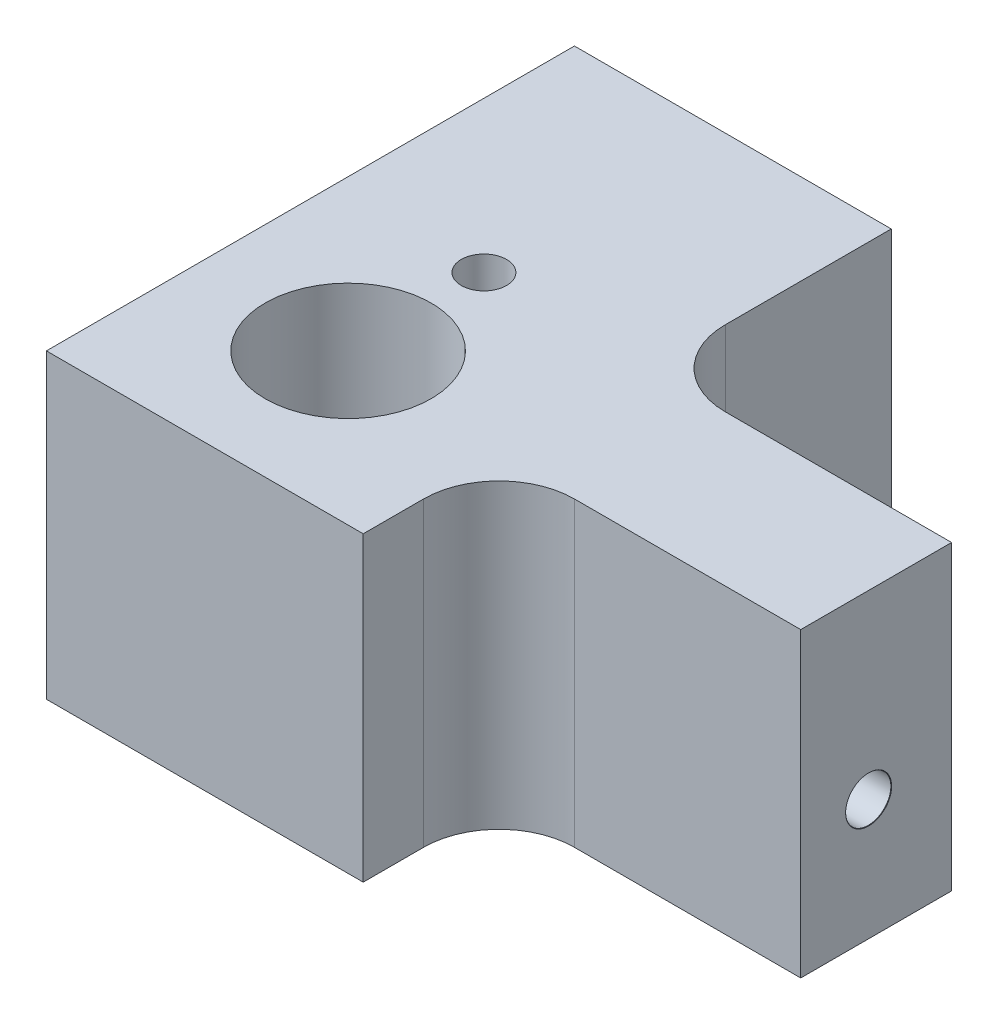
ISO-10303-21;
HEADER;
FILE_DESCRIPTION(('STEP AP214'),'2;1');
FILE_NAME('part.step','',(''),(''),'','','');
FILE_SCHEMA(('AUTOMOTIVE_DESIGN { 1 0 10303 214 1 1 1 1 }'));
ENDSEC;
DATA;
#1=APPLICATION_CONTEXT('core data for automotive mechanical design processes');
#2=APPLICATION_PROTOCOL_DEFINITION('international standard','automotive_design',2000,#1);
#3=PRODUCT_CONTEXT('',#1,'mechanical');
#4=PRODUCT('Part','Part','',(#3));
#5=PRODUCT_RELATED_PRODUCT_CATEGORY('part','',(#4));
#6=PRODUCT_DEFINITION_FORMATION('','',#4);
#7=PRODUCT_DEFINITION_CONTEXT('part definition',#1,'design');
#8=PRODUCT_DEFINITION('design','',#6,#7);
#9=PRODUCT_DEFINITION_SHAPE('','',#8);
#10=(LENGTH_UNIT() NAMED_UNIT(*) SI_UNIT(.MILLI.,.METRE.));
#11=(NAMED_UNIT(*) PLANE_ANGLE_UNIT() SI_UNIT($,.RADIAN.));
#12=(NAMED_UNIT(*) SI_UNIT($,.STERADIAN.) SOLID_ANGLE_UNIT());
#13=UNCERTAINTY_MEASURE_WITH_UNIT(LENGTH_MEASURE(1.E-05),#10,'distance_accuracy_value','');
#14=(GEOMETRIC_REPRESENTATION_CONTEXT(3) GLOBAL_UNCERTAINTY_ASSIGNED_CONTEXT((#13)) GLOBAL_UNIT_ASSIGNED_CONTEXT((#10,
#11,#12)) REPRESENTATION_CONTEXT('',''));
#15=CARTESIAN_POINT('',(0.,0.,0.));
#16=DIRECTION('',(0.,0.,1.));
#17=DIRECTION('',(1.,0.,0.));
#18=AXIS2_PLACEMENT_3D('',#15,#16,#17);
#19=CARTESIAN_POINT('',(-10.5255719557196,20.,12.690405904059));
#20=DIRECTION('',(0.,0.,-1.));
#21=DIRECTION('',(-1.,0.,0.));
#22=AXIS2_PLACEMENT_3D('',#19,#20,#21);
#23=PLANE('',#22);
#24=DIRECTION('',(1.,0.,0.));
#25=VECTOR('',#24,1.);
#26=CARTESIAN_POINT('',(-10.5255719557196,20.,12.690405904059));
#27=LINE('',#26,#25);
#28=CARTESIAN_POINT('',(-2.52557195571956,20.,12.690405904059));
#29=VERTEX_POINT('',#28);
#30=CARTESIAN_POINT('',(18.4744280442804,20.,12.690405904059));
#31=VERTEX_POINT('',#30);
#32=EDGE_CURVE('E142',#29,#31,#27,.T.);
#33=ORIENTED_EDGE('',*,*,#32,.F.);
#34=DIRECTION('',(0.,1.,0.));
#35=VECTOR('',#34,1.);
#36=CARTESIAN_POINT('',(-2.52557195571956,-8.00000000000001,12.690405904059));
#37=LINE('',#36,#35);
#38=CARTESIAN_POINT('',(-2.52557195571956,0.,12.690405904059));
#39=VERTEX_POINT('',#38);
#40=EDGE_CURVE('E123',#39,#29,#37,.T.);
#41=ORIENTED_EDGE('',*,*,#40,.F.);
#42=DIRECTION('',(1.,0.,0.));
#43=VECTOR('',#42,1.);
#44=CARTESIAN_POINT('',(-10.5255719557196,0.,12.690405904059));
#45=LINE('',#44,#43);
#46=CARTESIAN_POINT('',(18.4744280442804,0.,12.690405904059));
#47=VERTEX_POINT('',#46);
#48=EDGE_CURVE('E169',#39,#47,#45,.T.);
#49=ORIENTED_EDGE('',*,*,#48,.T.);
#50=DIRECTION('',(0.,1.,0.));
#51=VECTOR('',#50,1.);
#52=CARTESIAN_POINT('',(18.4744280442804,-8.00000000000001,12.690405904059));
#53=LINE('',#52,#51);
#54=EDGE_CURVE('E150',#47,#31,#53,.T.);
#55=ORIENTED_EDGE('',*,*,#54,.T.);
#56=EDGE_LOOP('',(#33,#41,#49,#55));
#57=FACE_BOUND('',#56,.T.);
#58=ADVANCED_FACE('F41',(#57),#23,.F.);
#59=CARTESIAN_POINT('',(38.4744280442804,20.,-22.309594095941));
#60=DIRECTION('',(-1.,0.,0.));
#61=DIRECTION('',(0.,0.,1.));
#62=AXIS2_PLACEMENT_3D('',#59,#60,#61);
#63=PLANE('',#62);
#64=CARTESIAN_POINT('',(38.4744280442804,8.,-0.809594095940968));
#65=DIRECTION('',(1.,0.,0.));
#66=DIRECTION('',(0.,0.,-1.));
#67=AXIS2_PLACEMENT_3D('',#64,#65,#66);
#68=CIRCLE('',#67,1.525);
#69=CARTESIAN_POINT('',(38.4744280442804,8.,-2.33459409594097));
#70=VERTEX_POINT('',#69);
#71=EDGE_CURVE('E258',#70,#70,#68,.T.);
#72=ORIENTED_EDGE('',*,*,#71,.F.);
#73=EDGE_LOOP('',(#72));
#74=FACE_BOUND('',#73,.T.);
#75=DIRECTION('',(0.,0.,-1.));
#76=VECTOR('',#75,1.);
#77=CARTESIAN_POINT('',(38.4744280442804,0.,-22.309594095941));
#78=LINE('',#77,#76);
#79=CARTESIAN_POINT('',(38.4744280442804,0.,3.69040590405904));
#80=VERTEX_POINT('',#79);
#81=CARTESIAN_POINT('',(38.4744280442804,0.,-6.30959409594096));
#82=VERTEX_POINT('',#81);
#83=EDGE_CURVE('E160',#80,#82,#78,.T.);
#84=ORIENTED_EDGE('',*,*,#83,.T.);
#85=DIRECTION('',(0.,1.,0.));
#86=VECTOR('',#85,1.);
#87=CARTESIAN_POINT('',(38.4744280442804,-8.00000000000001,-6.30959409594096));
#88=LINE('',#87,#86);
#89=CARTESIAN_POINT('',(38.4744280442804,20.,-6.30959409594096));
#90=VERTEX_POINT('',#89);
#91=EDGE_CURVE('E238',#82,#90,#88,.T.);
#92=ORIENTED_EDGE('',*,*,#91,.T.);
#93=DIRECTION('',(0.,0.,-1.));
#94=VECTOR('',#93,1.);
#95=CARTESIAN_POINT('',(38.4744280442804,20.,-22.309594095941));
#96=LINE('',#95,#94);
#97=CARTESIAN_POINT('',(38.4744280442804,20.,3.69040590405904));
#98=VERTEX_POINT('',#97);
#99=EDGE_CURVE('E152',#98,#90,#96,.T.);
#100=ORIENTED_EDGE('',*,*,#99,.F.);
#101=DIRECTION('',(0.,1.,0.));
#102=VECTOR('',#101,1.);
#103=CARTESIAN_POINT('',(38.4744280442804,-8.00000000000001,3.69040590405904));
#104=LINE('',#103,#102);
#105=EDGE_CURVE('E232',#80,#98,#104,.T.);
#106=ORIENTED_EDGE('',*,*,#105,.F.);
#107=EDGE_LOOP('',(#84,#92,#100,#106));
#108=FACE_BOUND('',#107,.T.);
#109=ADVANCED_FACE('F298',(#74,#108),#63,.F.);
#110=CARTESIAN_POINT('',(-10.5255719557196,20.,-22.309594095941));
#111=DIRECTION('',(0.,0.,1.));
#112=DIRECTION('',(1.,0.,0.));
#113=AXIS2_PLACEMENT_3D('',#110,#111,#112);
#114=PLANE('',#113);
#115=CARTESIAN_POINT('',(7.47442804428043,4.,-22.309594095941));
#116=DIRECTION('',(0.,0.,-1.));
#117=DIRECTION('',(-1.,0.,0.));
#118=AXIS2_PLACEMENT_3D('',#115,#116,#117);
#119=CIRCLE('',#118,1.525);
#120=CARTESIAN_POINT('',(5.94942804428043,4.,-22.309594095941));
#121=VERTEX_POINT('',#120);
#122=EDGE_CURVE('E270',#121,#121,#119,.T.);
#123=ORIENTED_EDGE('',*,*,#122,.F.);
#124=EDGE_LOOP('',(#123));
#125=FACE_BOUND('',#124,.T.);
#126=DIRECTION('',(-1.,0.,0.));
#127=VECTOR('',#126,1.);
#128=CARTESIAN_POINT('',(-10.5255719557196,0.,-22.309594095941));
#129=LINE('',#128,#127);
#130=CARTESIAN_POINT('',(18.4744280442804,0.,-22.309594095941));
#131=VERTEX_POINT('',#130);
#132=CARTESIAN_POINT('',(-2.52557195571957,0.,-22.309594095941));
#133=VERTEX_POINT('',#132);
#134=EDGE_CURVE('E153',#131,#133,#129,.T.);
#135=ORIENTED_EDGE('',*,*,#134,.T.);
#136=DIRECTION('',(0.,1.,0.));
#137=VECTOR('',#136,1.);
#138=CARTESIAN_POINT('',(-2.52557195571957,-8.00000000000001,-22.309594095941));
#139=LINE('',#138,#137);
#140=CARTESIAN_POINT('',(-2.52557195571957,20.,-22.309594095941));
#141=VERTEX_POINT('',#140);
#142=EDGE_CURVE('E135',#133,#141,#139,.T.);
#143=ORIENTED_EDGE('',*,*,#142,.T.);
#144=DIRECTION('',(-1.,0.,0.));
#145=VECTOR('',#144,1.);
#146=CARTESIAN_POINT('',(-10.5255719557196,20.,-22.309594095941));
#147=LINE('',#146,#145);
#148=CARTESIAN_POINT('',(18.4744280442804,20.,-22.309594095941));
#149=VERTEX_POINT('',#148);
#150=EDGE_CURVE('E144',#149,#141,#147,.T.);
#151=ORIENTED_EDGE('',*,*,#150,.F.);
#152=DIRECTION('',(0.,1.,0.));
#153=VECTOR('',#152,1.);
#154=CARTESIAN_POINT('',(18.4744280442804,-8.00000000000001,-22.309594095941));
#155=LINE('',#154,#153);
#156=EDGE_CURVE('E146',#131,#149,#155,.T.);
#157=ORIENTED_EDGE('',*,*,#156,.F.);
#158=EDGE_LOOP('',(#135,#143,#151,#157));
#159=FACE_BOUND('',#158,.T.);
#160=ADVANCED_FACE('F303',(#125,#159),#114,.F.);
#161=CARTESIAN_POINT('',(0.,20.,0.));
#162=DIRECTION('',(0.,1.,0.));
#163=DIRECTION('',(0.,0.,1.));
#164=AXIS2_PLACEMENT_3D('',#161,#162,#163);
#165=PLANE('',#164);
#166=CARTESIAN_POINT('',(7.47442804428044,20.,2.69040590405904));
#167=DIRECTION('',(0.,1.,0.));
#168=DIRECTION('',(0.,0.,1.));
#169=AXIS2_PLACEMENT_3D('',#166,#167,#168);
#170=CIRCLE('',#169,5.5);
#171=CARTESIAN_POINT('',(7.47442804428044,20.,8.19040590405904));
#172=VERTEX_POINT('',#171);
#173=EDGE_CURVE('E195',#172,#172,#170,.T.);
#174=ORIENTED_EDGE('',*,*,#173,.F.);
#175=EDGE_LOOP('',(#174));
#176=FACE_BOUND('',#175,.T.);
#177=DIRECTION('',(0.,0.,-1.));
#178=VECTOR('',#177,1.);
#179=CARTESIAN_POINT('',(-2.52557195571957,20.,-22.309594095941));
#180=LINE('',#179,#178);
#181=EDGE_CURVE('E126',#29,#141,#180,.T.);
#182=ORIENTED_EDGE('',*,*,#181,.F.);
#183=ORIENTED_EDGE('',*,*,#32,.T.);
#184=DIRECTION('',(0.,0.,1.));
#185=VECTOR('',#184,1.);
#186=CARTESIAN_POINT('',(18.4744280442804,20.,12.690405904059));
#187=LINE('',#186,#185);
#188=CARTESIAN_POINT('',(18.4744280442804,20.,8.69040590405904));
#189=VERTEX_POINT('',#188);
#190=EDGE_CURVE('E228',#189,#31,#187,.T.);
#191=ORIENTED_EDGE('',*,*,#190,.F.);
#192=CARTESIAN_POINT('',(23.4744280442804,20.,8.69040590405904));
#193=DIRECTION('',(0.,1.,0.));
#194=DIRECTION('',(0.,0.,1.));
#195=AXIS2_PLACEMENT_3D('',#192,#193,#194);
#196=CIRCLE('',#195,5.);
#197=CARTESIAN_POINT('',(23.4744280442804,20.,3.69040590405904));
#198=VERTEX_POINT('',#197);
#199=EDGE_CURVE('E208',#189,#198,#196,.F.);
#200=ORIENTED_EDGE('',*,*,#199,.T.);
#201=DIRECTION('',(-1.,0.,0.));
#202=VECTOR('',#201,1.);
#203=CARTESIAN_POINT('',(38.4744280442804,20.,3.69040590405904));
#204=LINE('',#203,#202);
#205=EDGE_CURVE('E194',#98,#198,#204,.T.);
#206=ORIENTED_EDGE('',*,*,#205,.F.);
#207=ORIENTED_EDGE('',*,*,#99,.T.);
#208=DIRECTION('',(1.,0.,0.));
#209=VECTOR('',#208,1.);
#210=CARTESIAN_POINT('',(18.4744280442804,20.,-6.30959409594096));
#211=LINE('',#210,#209);
#212=CARTESIAN_POINT('',(23.4744280442804,20.,-6.30959409594096));
#213=VERTEX_POINT('',#212);
#214=EDGE_CURVE('E366',#213,#90,#211,.T.);
#215=ORIENTED_EDGE('',*,*,#214,.F.);
#216=CARTESIAN_POINT('',(23.4744280442804,20.,-11.309594095941));
#217=DIRECTION('',(0.,1.,0.));
#218=DIRECTION('',(0.,0.,1.));
#219=AXIS2_PLACEMENT_3D('',#216,#217,#218);
#220=CIRCLE('',#219,5.);
#221=CARTESIAN_POINT('',(18.4744280442804,20.,-11.309594095941));
#222=VERTEX_POINT('',#221);
#223=EDGE_CURVE('E50',#213,#222,#220,.F.);
#224=ORIENTED_EDGE('',*,*,#223,.T.);
#225=DIRECTION('',(0.,0.,1.));
#226=VECTOR('',#225,1.);
#227=CARTESIAN_POINT('',(18.4744280442804,20.,-22.309594095941));
#228=LINE('',#227,#226);
#229=EDGE_CURVE('E243',#149,#222,#228,.T.);
#230=ORIENTED_EDGE('',*,*,#229,.F.);
#231=ORIENTED_EDGE('',*,*,#150,.T.);
#232=EDGE_LOOP('',(#182,#183,#191,#200,#206,#207,#215,#224,#230,#231));
#233=FACE_BOUND('',#232,.T.);
#234=CARTESIAN_POINT('',(7.47442804428044,20.,-6.30959409594097));
#235=DIRECTION('',(0.,-1.,0.));
#236=DIRECTION('',(0.,0.,-1.));
#237=AXIS2_PLACEMENT_3D('',#234,#235,#236);
#238=CIRCLE('',#237,1.49999999999999);
#239=CARTESIAN_POINT('',(7.47442804428044,20.,-7.80959409594096));
#240=VERTEX_POINT('',#239);
#241=EDGE_CURVE('E254',#240,#240,#238,.T.);
#242=ORIENTED_EDGE('',*,*,#241,.T.);
#243=EDGE_LOOP('',(#242));
#244=FACE_BOUND('',#243,.T.);
#245=ADVANCED_FACE('F139',(#176,#233,#244),#165,.T.);
#246=CARTESIAN_POINT('',(0.,0.,0.));
#247=DIRECTION('',(0.,1.,0.));
#248=DIRECTION('',(0.,0.,1.));
#249=AXIS2_PLACEMENT_3D('',#246,#247,#248);
#250=PLANE('',#249);
#251=CARTESIAN_POINT('',(7.47442804428044,0.,2.69040590405904));
#252=DIRECTION('',(0.,1.,0.));
#253=DIRECTION('',(0.,0.,1.));
#254=AXIS2_PLACEMENT_3D('',#251,#252,#253);
#255=CIRCLE('',#254,5.5);
#256=CARTESIAN_POINT('',(7.47442804428044,0.,8.19040590405904));
#257=VERTEX_POINT('',#256);
#258=EDGE_CURVE('E190',#257,#257,#255,.T.);
#259=ORIENTED_EDGE('',*,*,#258,.T.);
#260=EDGE_LOOP('',(#259));
#261=FACE_BOUND('',#260,.T.);
#262=CARTESIAN_POINT('',(7.47442804428044,0.,-6.30959409594097));
#263=DIRECTION('',(0.,-1.,0.));
#264=DIRECTION('',(0.,0.,-1.));
#265=AXIS2_PLACEMENT_3D('',#262,#263,#264);
#266=CIRCLE('',#265,1.525);
#267=CARTESIAN_POINT('',(7.47442804428044,0.,-7.83459409594097));
#268=VERTEX_POINT('',#267);
#269=EDGE_CURVE('E246',#268,#268,#266,.T.);
#270=ORIENTED_EDGE('',*,*,#269,.F.);
#271=EDGE_LOOP('',(#270));
#272=FACE_BOUND('',#271,.T.);
#273=ORIENTED_EDGE('',*,*,#48,.F.);
#274=DIRECTION('',(0.,0.,-1.));
#275=VECTOR('',#274,1.);
#276=CARTESIAN_POINT('',(-2.52557195571957,0.,0.));
#277=LINE('',#276,#275);
#278=EDGE_CURVE('E129',#39,#133,#277,.T.);
#279=ORIENTED_EDGE('',*,*,#278,.T.);
#280=ORIENTED_EDGE('',*,*,#134,.F.);
#281=DIRECTION('',(0.,0.,1.));
#282=VECTOR('',#281,1.);
#283=CARTESIAN_POINT('',(18.4744280442804,0.,0.));
#284=LINE('',#283,#282);
#285=CARTESIAN_POINT('',(18.4744280442804,0.,-11.309594095941));
#286=VERTEX_POINT('',#285);
#287=EDGE_CURVE('E184',#131,#286,#284,.T.);
#288=ORIENTED_EDGE('',*,*,#287,.T.);
#289=CARTESIAN_POINT('',(23.4744280442804,0.,-11.309594095941));
#290=DIRECTION('',(0.,1.,0.));
#291=DIRECTION('',(0.,0.,1.));
#292=AXIS2_PLACEMENT_3D('',#289,#290,#291);
#293=CIRCLE('',#292,5.);
#294=CARTESIAN_POINT('',(23.4744280442804,0.,-6.30959409594096));
#295=VERTEX_POINT('',#294);
#296=EDGE_CURVE('E11',#286,#295,#293,.T.);
#297=ORIENTED_EDGE('',*,*,#296,.T.);
#298=DIRECTION('',(1.,0.,0.));
#299=VECTOR('',#298,1.);
#300=CARTESIAN_POINT('',(0.,0.,-6.30959409594096));
#301=LINE('',#300,#299);
#302=EDGE_CURVE('E181',#295,#82,#301,.T.);
#303=ORIENTED_EDGE('',*,*,#302,.T.);
#304=ORIENTED_EDGE('',*,*,#83,.F.);
#305=DIRECTION('',(-1.,0.,0.));
#306=VECTOR('',#305,1.);
#307=CARTESIAN_POINT('',(0.,0.,3.69040590405905));
#308=LINE('',#307,#306);
#309=CARTESIAN_POINT('',(23.4744280442804,0.,3.69040590405904));
#310=VERTEX_POINT('',#309);
#311=EDGE_CURVE('E168',#80,#310,#308,.T.);
#312=ORIENTED_EDGE('',*,*,#311,.T.);
#313=CARTESIAN_POINT('',(23.4744280442804,0.,8.69040590405904));
#314=DIRECTION('',(0.,1.,0.));
#315=DIRECTION('',(0.,0.,1.));
#316=AXIS2_PLACEMENT_3D('',#313,#314,#315);
#317=CIRCLE('',#316,5.);
#318=CARTESIAN_POINT('',(18.4744280442804,0.,8.69040590405904));
#319=VERTEX_POINT('',#318);
#320=EDGE_CURVE('E211',#310,#319,#317,.T.);
#321=ORIENTED_EDGE('',*,*,#320,.T.);
#322=DIRECTION('',(0.,0.,1.));
#323=VECTOR('',#322,1.);
#324=CARTESIAN_POINT('',(18.4744280442804,0.,0.));
#325=LINE('',#324,#323);
#326=EDGE_CURVE('E178',#319,#47,#325,.T.);
#327=ORIENTED_EDGE('',*,*,#326,.T.);
#328=EDGE_LOOP('',(#273,#279,#280,#288,#297,#303,#304,#312,#321,#327));
#329=FACE_BOUND('',#328,.T.);
#330=ADVANCED_FACE('F217',(#261,#272,#329),#250,.F.);
#331=CARTESIAN_POINT('',(7.47442804428043,4.,-11.2108850244823));
#332=DIRECTION('',(0.,0.,-1.));
#333=DIRECTION('',(-1.,0.,0.));
#334=AXIS2_PLACEMENT_3D('',#331,#332,#333);
#335=CONICAL_SURFACE('',#334,1.5,1.02974425867665);
#336=CARTESIAN_POINT('',(7.47442804428043,4.,-10.309594095941));
#337=VERTEX_POINT('',#336);
#338=VERTEX_LOOP('',#337);
#339=FACE_BOUND('',#338,.T.);
#340=CARTESIAN_POINT('',(7.47442804428043,4.,-11.2108850244823));
#341=DIRECTION('',(0.,0.,-1.));
#342=DIRECTION('',(-1.,0.,0.));
#343=AXIS2_PLACEMENT_3D('',#340,#341,#342);
#344=CIRCLE('',#343,1.5);
#345=CARTESIAN_POINT('',(5.97442804428043,4.,-11.2108850244823));
#346=VERTEX_POINT('',#345);
#347=EDGE_CURVE('E163',#346,#346,#344,.T.);
#348=ORIENTED_EDGE('',*,*,#347,.T.);
#349=EDGE_LOOP('',(#348));
#350=FACE_BOUND('',#349,.T.);
#351=ADVANCED_FACE('F282',(#339,#350),#335,.F.);
#352=CARTESIAN_POINT('',(7.47442804428043,4.,-22.309594095941));
#353=DIRECTION('',(0.,0.,-1.));
#354=DIRECTION('',(-1.,0.,0.));
#355=AXIS2_PLACEMENT_3D('',#352,#353,#354);
#356=CYLINDRICAL_SURFACE('',#355,1.49999999999999);
#357=ORIENTED_EDGE('',*,*,#347,.F.);
#358=EDGE_LOOP('',(#357));
#359=FACE_BOUND('',#358,.T.);
#360=CARTESIAN_POINT('',(7.47442804428043,4.,-22.284594095941));
#361=DIRECTION('',(0.,0.,-1.));
#362=DIRECTION('',(-1.,0.,0.));
#363=AXIS2_PLACEMENT_3D('',#360,#361,#362);
#364=CIRCLE('',#363,1.49999999999999);
#365=CARTESIAN_POINT('',(5.97442804428044,4.,-22.284594095941));
#366=VERTEX_POINT('',#365);
#367=EDGE_CURVE('E273',#366,#366,#364,.T.);
#368=ORIENTED_EDGE('',*,*,#367,.T.);
#369=EDGE_LOOP('',(#368));
#370=FACE_BOUND('',#369,.T.);
#371=ADVANCED_FACE('F284',(#359,#370),#356,.F.);
#372=CARTESIAN_POINT('',(7.47442804428043,4.,-22.309594095941));
#373=DIRECTION('',(0.,0.,-1.));
#374=DIRECTION('',(-1.,0.,0.));
#375=AXIS2_PLACEMENT_3D('',#372,#373,#374);
#376=CONICAL_SURFACE('',#375,1.525,0.785398163397379);
#377=ORIENTED_EDGE('',*,*,#367,.F.);
#378=EDGE_LOOP('',(#377));
#379=FACE_BOUND('',#378,.T.);
#380=ORIENTED_EDGE('',*,*,#122,.T.);
#381=EDGE_LOOP('',(#380));
#382=FACE_BOUND('',#381,.T.);
#383=ADVANCED_FACE('F286',(#379,#382),#376,.F.);
#384=CARTESIAN_POINT('',(26.4744280442804,8.,-0.809594095940968));
#385=DIRECTION('',(1.,0.,0.));
#386=DIRECTION('',(0.,0.,-1.));
#387=AXIS2_PLACEMENT_3D('',#384,#385,#386);
#388=CONICAL_SURFACE('',#387,1.49999999999999,1.02974425867665);
#389=CARTESIAN_POINT('',(25.5731371157391,8.,-0.809594095940968));
#390=VERTEX_POINT('',#389);
#391=VERTEX_LOOP('',#390);
#392=FACE_BOUND('',#391,.T.);
#393=CARTESIAN_POINT('',(26.4744280442804,8.,-0.809594095940968));
#394=DIRECTION('',(1.,0.,0.));
#395=DIRECTION('',(0.,0.,-1.));
#396=AXIS2_PLACEMENT_3D('',#393,#394,#395);
#397=CIRCLE('',#396,1.49999999999999);
#398=CARTESIAN_POINT('',(26.4744280442804,8.,-2.30959409594096));
#399=VERTEX_POINT('',#398);
#400=EDGE_CURVE('E266',#399,#399,#397,.T.);
#401=ORIENTED_EDGE('',*,*,#400,.T.);
#402=EDGE_LOOP('',(#401));
#403=FACE_BOUND('',#402,.T.);
#404=ADVANCED_FACE('F292',(#392,#403),#388,.F.);
#405=CARTESIAN_POINT('',(38.4744280442804,8.,-0.809594095940968));
#406=DIRECTION('',(1.,0.,0.));
#407=DIRECTION('',(0.,0.,-1.));
#408=AXIS2_PLACEMENT_3D('',#405,#406,#407);
#409=CYLINDRICAL_SURFACE('',#408,1.49999999999999);
#410=ORIENTED_EDGE('',*,*,#400,.F.);
#411=EDGE_LOOP('',(#410));
#412=FACE_BOUND('',#411,.T.);
#413=CARTESIAN_POINT('',(38.4494280442804,8.,-0.809594095940968));
#414=DIRECTION('',(1.,0.,0.));
#415=DIRECTION('',(0.,0.,-1.));
#416=AXIS2_PLACEMENT_3D('',#413,#414,#415);
#417=CIRCLE('',#416,1.49999999999999);
#418=CARTESIAN_POINT('',(38.4494280442804,8.,-2.30959409594096));
#419=VERTEX_POINT('',#418);
#420=EDGE_CURVE('E262',#419,#419,#417,.T.);
#421=ORIENTED_EDGE('',*,*,#420,.T.);
#422=EDGE_LOOP('',(#421));
#423=FACE_BOUND('',#422,.T.);
#424=ADVANCED_FACE('F345',(#412,#423),#409,.F.);
#425=CARTESIAN_POINT('',(38.4744280442804,8.,-0.809594095940968));
#426=DIRECTION('',(1.,0.,0.));
#427=DIRECTION('',(0.,0.,-1.));
#428=AXIS2_PLACEMENT_3D('',#425,#426,#427);
#429=CONICAL_SURFACE('',#428,1.525,0.785398163397448);
#430=ORIENTED_EDGE('',*,*,#420,.F.);
#431=EDGE_LOOP('',(#430));
#432=FACE_BOUND('',#431,.T.);
#433=ORIENTED_EDGE('',*,*,#71,.T.);
#434=EDGE_LOOP('',(#433));
#435=FACE_BOUND('',#434,.T.);
#436=ADVANCED_FACE('F341',(#432,#435),#429,.F.);
#437=CARTESIAN_POINT('',(7.47442804428044,0.,-6.30959409594097));
#438=DIRECTION('',(0.,-1.,0.));
#439=DIRECTION('',(0.,0.,-1.));
#440=AXIS2_PLACEMENT_3D('',#437,#438,#439);
#441=CYLINDRICAL_SURFACE('',#440,1.49999999999999);
#442=ORIENTED_EDGE('',*,*,#241,.F.);
#443=EDGE_LOOP('',(#442));
#444=FACE_BOUND('',#443,.T.);
#445=CARTESIAN_POINT('',(7.47442804428044,0.0249999999999972,-6.30959409594097));
#446=DIRECTION('',(0.,-1.,0.));
#447=DIRECTION('',(0.,0.,-1.));
#448=AXIS2_PLACEMENT_3D('',#445,#446,#447);
#449=CIRCLE('',#448,1.49999999999999);
#450=CARTESIAN_POINT('',(7.47442804428044,0.0249999999999972,-7.80959409594095));
#451=VERTEX_POINT('',#450);
#452=EDGE_CURVE('E250',#451,#451,#449,.T.);
#453=ORIENTED_EDGE('',*,*,#452,.T.);
#454=EDGE_LOOP('',(#453));
#455=FACE_BOUND('',#454,.T.);
#456=ADVANCED_FACE('F337',(#444,#455),#441,.F.);
#457=CARTESIAN_POINT('',(7.47442804428044,0.,-6.30959409594097));
#458=DIRECTION('',(0.,-1.,0.));
#459=DIRECTION('',(0.,0.,-1.));
#460=AXIS2_PLACEMENT_3D('',#457,#458,#459);
#461=CONICAL_SURFACE('',#460,1.525,0.785398163397726);
#462=ORIENTED_EDGE('',*,*,#452,.F.);
#463=EDGE_LOOP('',(#462));
#464=FACE_BOUND('',#463,.T.);
#465=ORIENTED_EDGE('',*,*,#269,.T.);
#466=EDGE_LOOP('',(#465));
#467=FACE_BOUND('',#466,.T.);
#468=ADVANCED_FACE('F332',(#464,#467),#461,.F.);
#469=CARTESIAN_POINT('',(18.4744280442804,-8.00000000000001,12.690405904059));
#470=DIRECTION('',(-1.,0.,0.));
#471=DIRECTION('',(0.,0.,1.));
#472=AXIS2_PLACEMENT_3D('',#469,#470,#471);
#473=PLANE('',#472);
#474=ORIENTED_EDGE('',*,*,#326,.F.);
#475=DIRECTION('',(0.,1.,0.));
#476=VECTOR('',#475,1.);
#477=CARTESIAN_POINT('',(18.4744280442804,20.,8.69040590405904));
#478=LINE('',#477,#476);
#479=EDGE_CURVE('E189',#319,#189,#478,.T.);
#480=ORIENTED_EDGE('',*,*,#479,.T.);
#481=ORIENTED_EDGE('',*,*,#190,.T.);
#482=ORIENTED_EDGE('',*,*,#54,.F.);
#483=EDGE_LOOP('',(#474,#480,#481,#482));
#484=FACE_BOUND('',#483,.T.);
#485=ADVANCED_FACE('F223',(#484),#473,.F.);
#486=CARTESIAN_POINT('',(38.4744280442804,-8.00000000000001,3.69040590405904));
#487=DIRECTION('',(0.,0.,-1.));
#488=DIRECTION('',(-1.,0.,0.));
#489=AXIS2_PLACEMENT_3D('',#486,#487,#488);
#490=PLANE('',#489);
#491=ORIENTED_EDGE('',*,*,#205,.T.);
#492=DIRECTION('',(0.,1.,0.));
#493=VECTOR('',#492,1.);
#494=CARTESIAN_POINT('',(23.4744280442804,0.,3.69040590405904));
#495=LINE('',#494,#493);
#496=EDGE_CURVE('E199',#198,#310,#495,.F.);
#497=ORIENTED_EDGE('',*,*,#496,.T.);
#498=ORIENTED_EDGE('',*,*,#311,.F.);
#499=ORIENTED_EDGE('',*,*,#105,.T.);
#500=EDGE_LOOP('',(#491,#497,#498,#499));
#501=FACE_BOUND('',#500,.T.);
#502=ADVANCED_FACE('F230',(#501),#490,.F.);
#503=CARTESIAN_POINT('',(18.4744280442804,-8.00000000000001,-22.309594095941));
#504=DIRECTION('',(-1.,0.,0.));
#505=DIRECTION('',(0.,0.,1.));
#506=AXIS2_PLACEMENT_3D('',#503,#504,#505);
#507=PLANE('',#506);
#508=ORIENTED_EDGE('',*,*,#229,.T.);
#509=DIRECTION('',(0.,1.,0.));
#510=VECTOR('',#509,1.);
#511=CARTESIAN_POINT('',(18.4744280442804,0.,-11.309594095941));
#512=LINE('',#511,#510);
#513=EDGE_CURVE('E57',#222,#286,#512,.F.);
#514=ORIENTED_EDGE('',*,*,#513,.T.);
#515=ORIENTED_EDGE('',*,*,#287,.F.);
#516=ORIENTED_EDGE('',*,*,#156,.T.);
#517=EDGE_LOOP('',(#508,#514,#515,#516));
#518=FACE_BOUND('',#517,.T.);
#519=ADVANCED_FACE('F326',(#518),#507,.F.);
#520=CARTESIAN_POINT('',(18.4744280442804,-8.00000000000001,-6.30959409594096));
#521=DIRECTION('',(0.,0.,1.));
#522=DIRECTION('',(1.,0.,0.));
#523=AXIS2_PLACEMENT_3D('',#520,#521,#522);
#524=PLANE('',#523);
#525=ORIENTED_EDGE('',*,*,#302,.F.);
#526=DIRECTION('',(0.,1.,0.));
#527=VECTOR('',#526,1.);
#528=CARTESIAN_POINT('',(23.4744280442804,20.,-6.30959409594096));
#529=LINE('',#528,#527);
#530=EDGE_CURVE('E202',#295,#213,#529,.T.);
#531=ORIENTED_EDGE('',*,*,#530,.T.);
#532=ORIENTED_EDGE('',*,*,#214,.T.);
#533=ORIENTED_EDGE('',*,*,#91,.F.);
#534=EDGE_LOOP('',(#525,#531,#532,#533));
#535=FACE_BOUND('',#534,.T.);
#536=ADVANCED_FACE('F319',(#535),#524,.F.);
#537=CARTESIAN_POINT('',(-2.52557195571957,-8.00000000000001,-22.309594095941));
#538=DIRECTION('',(1.,0.,0.));
#539=DIRECTION('',(0.,0.,-1.));
#540=AXIS2_PLACEMENT_3D('',#537,#538,#539);
#541=PLANE('',#540);
#542=ORIENTED_EDGE('',*,*,#40,.T.);
#543=ORIENTED_EDGE('',*,*,#181,.T.);
#544=ORIENTED_EDGE('',*,*,#142,.F.);
#545=ORIENTED_EDGE('',*,*,#278,.F.);
#546=EDGE_LOOP('',(#542,#543,#544,#545));
#547=FACE_BOUND('',#546,.T.);
#548=ADVANCED_FACE('F125',(#547),#541,.F.);
#549=CARTESIAN_POINT('',(7.47442804428044,-10.,2.69040590405904));
#550=DIRECTION('',(0.,1.,0.));
#551=DIRECTION('',(0.,0.,1.));
#552=AXIS2_PLACEMENT_3D('',#549,#550,#551);
#553=CYLINDRICAL_SURFACE('',#552,5.5);
#554=ORIENTED_EDGE('',*,*,#173,.T.);
#555=EDGE_LOOP('',(#554));
#556=FACE_BOUND('',#555,.T.);
#557=ORIENTED_EDGE('',*,*,#258,.F.);
#558=EDGE_LOOP('',(#557));
#559=FACE_BOUND('',#558,.T.);
#560=ADVANCED_FACE('F308',(#556,#559),#553,.F.);
#561=CARTESIAN_POINT('',(23.4744280442804,-8.00000000000001,8.69040590405904));
#562=DIRECTION('',(0.,-1.,0.));
#563=DIRECTION('',(0.,0.,-1.));
#564=AXIS2_PLACEMENT_3D('',#561,#562,#563);
#565=CYLINDRICAL_SURFACE('',#564,5.);
#566=ORIENTED_EDGE('',*,*,#320,.F.);
#567=ORIENTED_EDGE('',*,*,#496,.F.);
#568=ORIENTED_EDGE('',*,*,#199,.F.);
#569=ORIENTED_EDGE('',*,*,#479,.F.);
#570=EDGE_LOOP('',(#566,#567,#568,#569));
#571=FACE_BOUND('',#570,.T.);
#572=ADVANCED_FACE('F224',(#571),#565,.F.);
#573=CARTESIAN_POINT('',(23.4744280442804,-8.00000000000001,-11.309594095941));
#574=DIRECTION('',(0.,-1.,0.));
#575=DIRECTION('',(0.,0.,-1.));
#576=AXIS2_PLACEMENT_3D('',#573,#574,#575);
#577=CYLINDRICAL_SURFACE('',#576,5.);
#578=ORIENTED_EDGE('',*,*,#296,.F.);
#579=ORIENTED_EDGE('',*,*,#513,.F.);
#580=ORIENTED_EDGE('',*,*,#223,.F.);
#581=ORIENTED_EDGE('',*,*,#530,.F.);
#582=EDGE_LOOP('',(#578,#579,#580,#581));
#583=FACE_BOUND('',#582,.T.);
#584=ADVANCED_FACE('F43',(#583),#577,.F.);
#585=CLOSED_SHELL('',(#58,#109,#160,#245,#330,#351,#371,#383,#404,#424,#436,#456,#468,#485,#502,
#519,#536,#548,#560,#572,#584));
#586=MANIFOLD_SOLID_BREP('B2',#585);
#587=ADVANCED_BREP_SHAPE_REPRESENTATION('',(#18,#586),#14);
#588=SHAPE_DEFINITION_REPRESENTATION(#9,#587);
ENDSEC;
END-ISO-10303-21;
